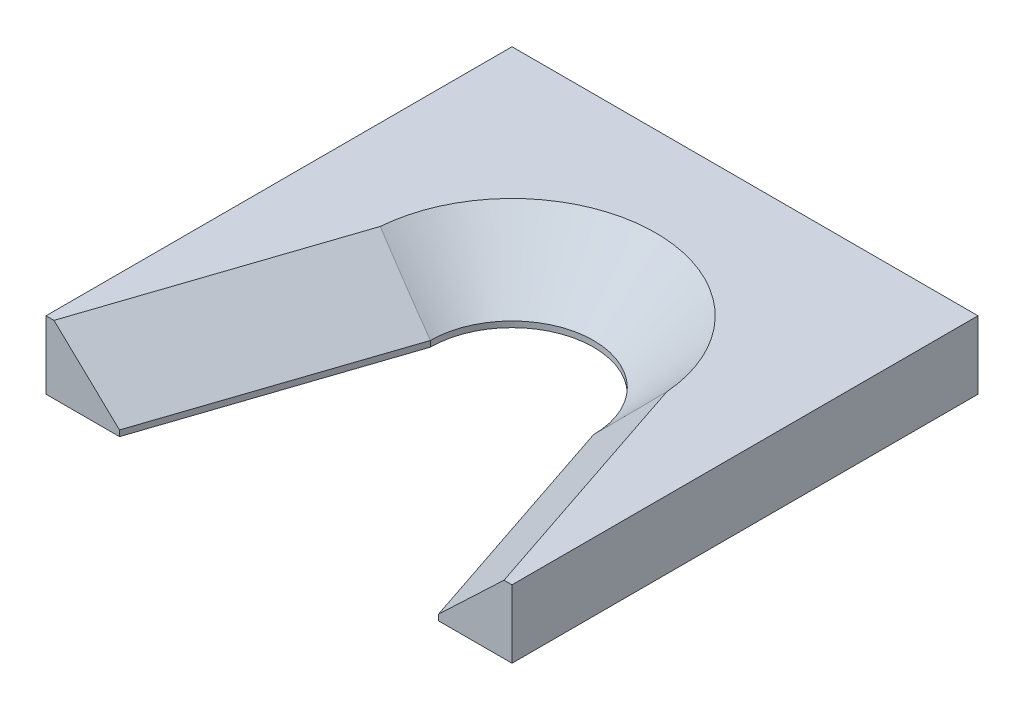
ISO-10303-21;
HEADER;
FILE_DESCRIPTION(('STEP AP214'),'2;1');
FILE_NAME('part.step','',(''),(''),'','','');
FILE_SCHEMA(('AUTOMOTIVE_DESIGN { 1 0 10303 214 1 1 1 1 }'));
ENDSEC;
DATA;
#1=APPLICATION_CONTEXT('core data for automotive mechanical design processes');
#2=APPLICATION_PROTOCOL_DEFINITION('international standard','automotive_design',2000,#1);
#3=PRODUCT_CONTEXT('',#1,'mechanical');
#4=PRODUCT('Part','Part','',(#3));
#5=PRODUCT_RELATED_PRODUCT_CATEGORY('part','',(#4));
#6=PRODUCT_DEFINITION_FORMATION('','',#4);
#7=PRODUCT_DEFINITION_CONTEXT('part definition',#1,'design');
#8=PRODUCT_DEFINITION('design','',#6,#7);
#9=PRODUCT_DEFINITION_SHAPE('','',#8);
#10=(LENGTH_UNIT() NAMED_UNIT(*) SI_UNIT(.MILLI.,.METRE.));
#11=(NAMED_UNIT(*) PLANE_ANGLE_UNIT() SI_UNIT($,.RADIAN.));
#12=(NAMED_UNIT(*) SI_UNIT($,.STERADIAN.) SOLID_ANGLE_UNIT());
#13=UNCERTAINTY_MEASURE_WITH_UNIT(LENGTH_MEASURE(1.E-05),#10,'distance_accuracy_value','');
#14=(GEOMETRIC_REPRESENTATION_CONTEXT(3) GLOBAL_UNCERTAINTY_ASSIGNED_CONTEXT((#13)) GLOBAL_UNIT_ASSIGNED_CONTEXT((#10,
#11,#12)) REPRESENTATION_CONTEXT('',''));
#15=CARTESIAN_POINT('',(0.,0.,0.));
#16=DIRECTION('',(0.,0.,1.));
#17=DIRECTION('',(1.,0.,0.));
#18=AXIS2_PLACEMENT_3D('',#15,#16,#17);
#19=CARTESIAN_POINT('',(0.,11.1125,0.));
#20=DIRECTION('',(0.,-1.,0.));
#21=DIRECTION('',(0.,0.,-1.));
#22=AXIS2_PLACEMENT_3D('',#19,#20,#21);
#23=CYLINDRICAL_SURFACE('',#22,13.335);
#24=DIRECTION('',(0.,-1.,0.));
#25=VECTOR('',#24,1.);
#26=CARTESIAN_POINT('',(13.335,11.1125,0.));
#27=LINE('',#26,#25);
#28=CARTESIAN_POINT('',(13.335,0.952500000000011,0.));
#29=VERTEX_POINT('',#28);
#30=CARTESIAN_POINT('',(13.335,0.,0.));
#31=VERTEX_POINT('',#30);
#32=EDGE_CURVE('E193',#29,#31,#27,.T.);
#33=ORIENTED_EDGE('',*,*,#32,.F.);
#34=CARTESIAN_POINT('',(0.,0.952500000000011,0.));
#35=DIRECTION('',(0.,1.,0.));
#36=DIRECTION('',(0.,0.,1.));
#37=AXIS2_PLACEMENT_3D('',#34,#35,#36);
#38=CIRCLE('',#37,13.335);
#39=CARTESIAN_POINT('',(-13.335,0.952500000000012,0.));
#40=VERTEX_POINT('',#39);
#41=EDGE_CURVE('E73',#29,#40,#38,.T.);
#42=ORIENTED_EDGE('',*,*,#41,.T.);
#43=DIRECTION('',(0.,-1.,0.));
#44=VECTOR('',#43,1.);
#45=CARTESIAN_POINT('',(-13.335,11.1125,0.));
#46=LINE('',#45,#44);
#47=CARTESIAN_POINT('',(-13.335,0.,0.));
#48=VERTEX_POINT('',#47);
#49=EDGE_CURVE('E178',#40,#48,#46,.T.);
#50=ORIENTED_EDGE('',*,*,#49,.T.);
#51=CARTESIAN_POINT('',(0.,0.,0.));
#52=DIRECTION('',(0.,1.,0.));
#53=DIRECTION('',(0.,0.,1.));
#54=AXIS2_PLACEMENT_3D('',#51,#52,#53);
#55=CIRCLE('',#54,13.335);
#56=EDGE_CURVE('E158',#31,#48,#55,.T.);
#57=ORIENTED_EDGE('',*,*,#56,.F.);
#58=EDGE_LOOP('',(#33,#42,#50,#57));
#59=FACE_BOUND('',#58,.T.);
#60=ADVANCED_FACE('F42',(#59),#23,.F.);
#61=CARTESIAN_POINT('',(11.9924022632403,11.1125,-4.01260166686629));
#62=DIRECTION('',(0.948323655206199,0.,-0.317304656405093));
#63=DIRECTION('',(-0.317304656405093,0.,-0.948323655206199));
#64=AXIS2_PLACEMENT_3D('',#61,#62,#63);
#65=PLANE('',#64);
#66=DIRECTION('',(0.,-1.,0.));
#67=VECTOR('',#66,1.);
#68=CARTESIAN_POINT('',(26.083081673029,11.1125,38.1));
#69=LINE('',#68,#67);
#70=CARTESIAN_POINT('',(26.083081673029,0.952500000000009,38.1));
#71=VERTEX_POINT('',#70);
#72=CARTESIAN_POINT('',(26.083081673029,0.,38.1));
#73=VERTEX_POINT('',#72);
#74=EDGE_CURVE('E191',#71,#73,#69,.T.);
#75=ORIENTED_EDGE('',*,*,#74,.F.);
#76=DIRECTION('',(-0.317304656405093,0.,-0.948323655206199));
#77=VECTOR('',#76,1.);
#78=CARTESIAN_POINT('',(13.335,0.952500000000008,0.));
#79=LINE('',#78,#77);
#80=EDGE_CURVE('E204',#71,#29,#79,.T.);
#81=ORIENTED_EDGE('',*,*,#80,.T.);
#82=ORIENTED_EDGE('',*,*,#32,.T.);
#83=DIRECTION('',(0.317304656405093,0.,0.948323655206199));
#84=VECTOR('',#83,1.);
#85=CARTESIAN_POINT('',(11.9924022632403,0.,-4.01260166686629));
#86=LINE('',#85,#84);
#87=EDGE_CURVE('E161',#31,#73,#86,.T.);
#88=ORIENTED_EDGE('',*,*,#87,.T.);
#89=EDGE_LOOP('',(#75,#81,#82,#88));
#90=FACE_BOUND('',#89,.T.);
#91=ADVANCED_FACE('F226',(#90),#65,.F.);
#92=CARTESIAN_POINT('',(0.,11.1125,38.1));
#93=DIRECTION('',(0.,0.,1.));
#94=DIRECTION('',(1.,0.,0.));
#95=AXIS2_PLACEMENT_3D('',#92,#93,#94);
#96=PLANE('',#95);
#97=DIRECTION('',(-1.,0.,0.));
#98=VECTOR('',#97,1.);
#99=CARTESIAN_POINT('',(0.,11.1125,38.1));
#100=LINE('',#99,#98);
#101=CARTESIAN_POINT('',(38.1,11.1125,38.1));
#102=VERTEX_POINT('',#101);
#103=CARTESIAN_POINT('',(36.7967235232799,11.1125,38.1));
#104=VERTEX_POINT('',#103);
#105=EDGE_CURVE('E145',#102,#104,#100,.T.);
#106=ORIENTED_EDGE('',*,*,#105,.T.);
#107=DIRECTION('',(-0.725606535862985,-0.688109842331091,0.));
#108=VECTOR('',#107,1.);
#109=CARTESIAN_POINT('',(17.4230703123026,-7.25999362773124,38.1));
#110=LINE('',#109,#108);
#111=EDGE_CURVE('E202',#104,#71,#110,.T.);
#112=ORIENTED_EDGE('',*,*,#111,.T.);
#113=ORIENTED_EDGE('',*,*,#74,.T.);
#114=DIRECTION('',(-1.,0.,0.));
#115=VECTOR('',#114,1.);
#116=CARTESIAN_POINT('',(0.,0.,38.1));
#117=LINE('',#116,#115);
#118=CARTESIAN_POINT('',(38.1,0.,38.1));
#119=VERTEX_POINT('',#118);
#120=EDGE_CURVE('E164',#119,#73,#117,.T.);
#121=ORIENTED_EDGE('',*,*,#120,.F.);
#122=DIRECTION('',(0.,-1.,0.));
#123=VECTOR('',#122,1.);
#124=CARTESIAN_POINT('',(38.1,11.1125,38.1));
#125=LINE('',#124,#123);
#126=EDGE_CURVE('E189',#102,#119,#125,.T.);
#127=ORIENTED_EDGE('',*,*,#126,.F.);
#128=EDGE_LOOP('',(#106,#112,#113,#121,#127));
#129=FACE_BOUND('',#128,.T.);
#130=ADVANCED_FACE('F230',(#129),#96,.T.);
#131=CARTESIAN_POINT('',(38.1,11.1125,0.));
#132=DIRECTION('',(1.,0.,0.));
#133=DIRECTION('',(0.,0.,-1.));
#134=AXIS2_PLACEMENT_3D('',#131,#132,#133);
#135=PLANE('',#134);
#136=DIRECTION('',(0.,0.,1.));
#137=VECTOR('',#136,1.);
#138=CARTESIAN_POINT('',(38.1,0.,0.));
#139=LINE('',#138,#137);
#140=CARTESIAN_POINT('',(38.1,0.,-38.1));
#141=VERTEX_POINT('',#140);
#142=EDGE_CURVE('E167',#141,#119,#139,.T.);
#143=ORIENTED_EDGE('',*,*,#142,.F.);
#144=DIRECTION('',(0.,-1.,0.));
#145=VECTOR('',#144,1.);
#146=CARTESIAN_POINT('',(38.1,11.1125,-38.1));
#147=LINE('',#146,#145);
#148=CARTESIAN_POINT('',(38.1,11.1125,-38.1));
#149=VERTEX_POINT('',#148);
#150=EDGE_CURVE('E187',#149,#141,#147,.T.);
#151=ORIENTED_EDGE('',*,*,#150,.F.);
#152=DIRECTION('',(0.,0.,1.));
#153=VECTOR('',#152,1.);
#154=CARTESIAN_POINT('',(38.1,11.1125,0.));
#155=LINE('',#154,#153);
#156=EDGE_CURVE('E148',#149,#102,#155,.T.);
#157=ORIENTED_EDGE('',*,*,#156,.T.);
#158=ORIENTED_EDGE('',*,*,#126,.T.);
#159=EDGE_LOOP('',(#143,#151,#157,#158));
#160=FACE_BOUND('',#159,.T.);
#161=ADVANCED_FACE('F234',(#160),#135,.T.);
#162=CARTESIAN_POINT('',(0.,11.1125,-38.1));
#163=DIRECTION('',(0.,0.,1.));
#164=DIRECTION('',(1.,0.,0.));
#165=AXIS2_PLACEMENT_3D('',#162,#163,#164);
#166=PLANE('',#165);
#167=CARTESIAN_POINT('',(0.,5.55625,-38.1));
#168=DIRECTION('',(0.,0.,-1.));
#169=DIRECTION('',(-1.,0.,0.));
#170=AXIS2_PLACEMENT_3D('',#167,#168,#169);
#171=CIRCLE('',#170,1.7272);
#172=CARTESIAN_POINT('',(-1.72719999999999,5.55625,-38.1));
#173=VERTEX_POINT('',#172);
#174=EDGE_CURVE('E139',#173,#173,#171,.T.);
#175=ORIENTED_EDGE('',*,*,#174,.F.);
#176=EDGE_LOOP('',(#175));
#177=FACE_BOUND('',#176,.T.);
#178=DIRECTION('',(-1.,0.,0.));
#179=VECTOR('',#178,1.);
#180=CARTESIAN_POINT('',(0.,0.,-38.1));
#181=LINE('',#180,#179);
#182=CARTESIAN_POINT('',(-38.1,0.,-38.1));
#183=VERTEX_POINT('',#182);
#184=EDGE_CURVE('E171',#141,#183,#181,.T.);
#185=ORIENTED_EDGE('',*,*,#184,.T.);
#186=DIRECTION('',(0.,-1.,0.));
#187=VECTOR('',#186,1.);
#188=CARTESIAN_POINT('',(-38.1,11.1125,-38.1));
#189=LINE('',#188,#187);
#190=CARTESIAN_POINT('',(-38.1,11.1125,-38.1));
#191=VERTEX_POINT('',#190);
#192=EDGE_CURVE('E184',#191,#183,#189,.T.);
#193=ORIENTED_EDGE('',*,*,#192,.F.);
#194=DIRECTION('',(-1.,0.,0.));
#195=VECTOR('',#194,1.);
#196=CARTESIAN_POINT('',(0.,11.1125,-38.1));
#197=LINE('',#196,#195);
#198=EDGE_CURVE('E153',#149,#191,#197,.T.);
#199=ORIENTED_EDGE('',*,*,#198,.F.);
#200=ORIENTED_EDGE('',*,*,#150,.T.);
#201=EDGE_LOOP('',(#185,#193,#199,#200));
#202=FACE_BOUND('',#201,.T.);
#203=ADVANCED_FACE('F237',(#177,#202),#166,.F.);
#204=CARTESIAN_POINT('',(-38.1,11.1125,0.));
#205=DIRECTION('',(1.,0.,0.));
#206=DIRECTION('',(0.,0.,-1.));
#207=AXIS2_PLACEMENT_3D('',#204,#205,#206);
#208=PLANE('',#207);
#209=DIRECTION('',(0.,0.,1.));
#210=VECTOR('',#209,1.);
#211=CARTESIAN_POINT('',(-38.1,0.,0.));
#212=LINE('',#211,#210);
#213=CARTESIAN_POINT('',(-38.1,0.,38.1));
#214=VERTEX_POINT('',#213);
#215=EDGE_CURVE('E173',#183,#214,#212,.T.);
#216=ORIENTED_EDGE('',*,*,#215,.T.);
#217=DIRECTION('',(0.,-1.,0.));
#218=VECTOR('',#217,1.);
#219=CARTESIAN_POINT('',(-38.1,11.1125,38.1));
#220=LINE('',#219,#218);
#221=CARTESIAN_POINT('',(-38.1,11.1125,38.1));
#222=VERTEX_POINT('',#221);
#223=EDGE_CURVE('E182',#222,#214,#220,.T.);
#224=ORIENTED_EDGE('',*,*,#223,.F.);
#225=DIRECTION('',(0.,0.,1.));
#226=VECTOR('',#225,1.);
#227=CARTESIAN_POINT('',(-38.1,11.1125,0.));
#228=LINE('',#227,#226);
#229=EDGE_CURVE('E155',#191,#222,#228,.T.);
#230=ORIENTED_EDGE('',*,*,#229,.F.);
#231=ORIENTED_EDGE('',*,*,#192,.T.);
#232=EDGE_LOOP('',(#216,#224,#230,#231));
#233=FACE_BOUND('',#232,.T.);
#234=ADVANCED_FACE('F241',(#233),#208,.F.);
#235=DIRECTION('',(0.,-1.,0.));
#236=VECTOR('',#235,1.);
#237=CARTESIAN_POINT('',(-26.083081673029,11.1125,38.1));
#238=LINE('',#237,#236);
#239=CARTESIAN_POINT('',(-26.083081673029,0.952500000000012,38.1));
#240=VERTEX_POINT('',#239);
#241=CARTESIAN_POINT('',(-26.083081673029,0.,38.1));
#242=VERTEX_POINT('',#241);
#243=EDGE_CURVE('E180',#240,#242,#238,.T.);
#244=ORIENTED_EDGE('',*,*,#243,.F.);
#245=DIRECTION('',(0.725606535862985,-0.688109842331091,0.));
#246=VECTOR('',#245,1.);
#247=CARTESIAN_POINT('',(-17.4230703123026,-7.25999362773123,38.1));
#248=LINE('',#247,#246);
#249=CARTESIAN_POINT('',(-36.7967235232799,11.1125,38.1));
#250=VERTEX_POINT('',#249);
#251=EDGE_CURVE('E11',#240,#250,#248,.F.);
#252=ORIENTED_EDGE('',*,*,#251,.T.);
#253=EDGE_CURVE('E150',#250,#222,#100,.T.);
#254=ORIENTED_EDGE('',*,*,#253,.T.);
#255=ORIENTED_EDGE('',*,*,#223,.T.);
#256=EDGE_CURVE('E168',#242,#214,#117,.T.);
#257=ORIENTED_EDGE('',*,*,#256,.F.);
#258=EDGE_LOOP('',(#244,#252,#254,#255,#257));
#259=FACE_BOUND('',#258,.T.);
#260=ADVANCED_FACE('F245',(#259),#96,.T.);
#261=CARTESIAN_POINT('',(-11.9924022632403,11.1125,-4.01260166686629));
#262=DIRECTION('',(0.948323655206199,0.,0.317304656405093));
#263=DIRECTION('',(0.317304656405093,0.,-0.948323655206199));
#264=AXIS2_PLACEMENT_3D('',#261,#262,#263);
#265=PLANE('',#264);
#266=ORIENTED_EDGE('',*,*,#49,.F.);
#267=DIRECTION('',(-0.317304656405093,0.,0.948323655206199));
#268=VECTOR('',#267,1.);
#269=CARTESIAN_POINT('',(-11.9924022632403,0.952500000000012,-4.01260166686629));
#270=LINE('',#269,#268);
#271=EDGE_CURVE('E58',#40,#240,#270,.T.);
#272=ORIENTED_EDGE('',*,*,#271,.T.);
#273=ORIENTED_EDGE('',*,*,#243,.T.);
#274=DIRECTION('',(-0.317304656405093,0.,0.948323655206199));
#275=VECTOR('',#274,1.);
#276=CARTESIAN_POINT('',(-11.9924022632403,0.,-4.01260166686629));
#277=LINE('',#276,#275);
#278=EDGE_CURVE('E149',#48,#242,#277,.T.);
#279=ORIENTED_EDGE('',*,*,#278,.F.);
#280=EDGE_LOOP('',(#266,#272,#273,#279));
#281=FACE_BOUND('',#280,.T.);
#282=ADVANCED_FACE('F249',(#281),#265,.T.);
#283=CARTESIAN_POINT('',(0.,11.1125,0.));
#284=DIRECTION('',(0.,1.,0.));
#285=DIRECTION('',(0.,0.,1.));
#286=AXIS2_PLACEMENT_3D('',#283,#284,#285);
#287=PLANE('',#286);
#288=CARTESIAN_POINT('',(0.,11.1125,0.));
#289=DIRECTION('',(0.,1.,0.));
#290=DIRECTION('',(0.,0.,1.));
#291=AXIS2_PLACEMENT_3D('',#288,#289,#290);
#292=CIRCLE('',#291,23.495);
#293=CARTESIAN_POINT('',(-23.4196823274798,11.1125,-1.87976186787994));
#294=VERTEX_POINT('',#293);
#295=CARTESIAN_POINT('',(23.4196823274797,11.1125,-1.87976186788));
#296=VERTEX_POINT('',#295);
#297=EDGE_CURVE('E197',#294,#296,#292,.F.);
#298=ORIENTED_EDGE('',*,*,#297,.T.);
#299=DIRECTION('',(0.317304656405093,0.,0.948323655206199));
#300=VECTOR('',#299,1.);
#301=CARTESIAN_POINT('',(35.718050009924,11.1125,34.8761846909243));
#302=LINE('',#301,#300);
#303=EDGE_CURVE('E199',#296,#104,#302,.T.);
#304=ORIENTED_EDGE('',*,*,#303,.T.);
#305=ORIENTED_EDGE('',*,*,#105,.F.);
#306=ORIENTED_EDGE('',*,*,#156,.F.);
#307=ORIENTED_EDGE('',*,*,#198,.T.);
#308=ORIENTED_EDGE('',*,*,#229,.T.);
#309=ORIENTED_EDGE('',*,*,#253,.F.);
#310=DIRECTION('',(0.317304656405093,0.,-0.948323655206199));
#311=VECTOR('',#310,1.);
#312=CARTESIAN_POINT('',(-21.6273706001353,11.1125,-7.23641697594204));
#313=LINE('',#312,#311);
#314=EDGE_CURVE('E195',#250,#294,#313,.T.);
#315=ORIENTED_EDGE('',*,*,#314,.T.);
#316=EDGE_LOOP('',(#298,#304,#305,#306,#307,#308,#309,#315));
#317=FACE_BOUND('',#316,.T.);
#318=ADVANCED_FACE('F253',(#317),#287,.T.);
#319=CARTESIAN_POINT('',(0.,0.,0.));
#320=DIRECTION('',(0.,1.,0.));
#321=DIRECTION('',(0.,0.,1.));
#322=AXIS2_PLACEMENT_3D('',#319,#320,#321);
#323=PLANE('',#322);
#324=ORIENTED_EDGE('',*,*,#56,.T.);
#325=ORIENTED_EDGE('',*,*,#278,.T.);
#326=ORIENTED_EDGE('',*,*,#256,.T.);
#327=ORIENTED_EDGE('',*,*,#215,.F.);
#328=ORIENTED_EDGE('',*,*,#184,.F.);
#329=ORIENTED_EDGE('',*,*,#142,.T.);
#330=ORIENTED_EDGE('',*,*,#120,.T.);
#331=ORIENTED_EDGE('',*,*,#87,.F.);
#332=EDGE_LOOP('',(#324,#325,#326,#327,#328,#329,#330,#331));
#333=FACE_BOUND('',#332,.T.);
#334=ADVANCED_FACE('F254',(#333),#323,.F.);
#335=CARTESIAN_POINT('',(-11.9924022632403,0.952500000000011,-4.01260166686629));
#336=DIRECTION('',(-0.670566087355916,-0.707106781186549,-0.224368274246108));
#337=DIRECTION('',(-0.317304656405093,0.,0.948323655206199));
#338=AXIS2_PLACEMENT_3D('',#335,#336,#337);
#339=PLANE('',#338);
#340=ORIENTED_EDGE('',*,*,#251,.F.);
#341=ORIENTED_EDGE('',*,*,#271,.F.);
#342=CARTESIAN_POINT('',(-13.335,0.952500000000012,0.));
#343=CARTESIAN_POINT('',(-14.1802182107889,1.79777629778931,-0.137835590509843));
#344=CARTESIAN_POINT('',(-15.0239193030969,2.64354546694068,-0.28175867663717));
#345=CARTESIAN_POINT('',(-16.708748163143,4.33580986815329,-0.579583925492418));
#346=CARTESIAN_POINT('',(-17.5498760556182,5.1823050623891,-0.733485596212048));
#347=CARTESIAN_POINT('',(-19.2300756855446,6.87581802542853,-1.04908105467809));
#348=CARTESIAN_POINT('',(-20.0691474880417,7.72283577661118,-1.21077459248934));
#349=CARTESIAN_POINT('',(-21.7456096435228,9.41734861276061,-1.54069133003352));
#350=CARTESIAN_POINT('',(-22.5829999124839,10.2648437189974,-1.70891484791784));
#351=CARTESIAN_POINT('',(-23.4196823274798,11.1125,-1.87976186787987));
#352=B_SPLINE_CURVE_WITH_KNOTS('',3,(#342,#343,#344,#345,#346,#347,#348,#349,#350,#351),
.UNSPECIFIED.,.F.,.F.,(4,2,2,2,4),(0.,3.60979400428527,7.21941015770133,10.8289106045433,
14.4385871334727),.UNSPECIFIED.);
#353=EDGE_CURVE('E48',#294,#40,#352,.F.);
#354=ORIENTED_EDGE('',*,*,#353,.F.);
#355=ORIENTED_EDGE('',*,*,#314,.F.);
#356=EDGE_LOOP('',(#340,#341,#354,#355));
#357=FACE_BOUND('',#356,.T.);
#358=ADVANCED_FACE('F45',(#357),#339,.F.);
#359=CARTESIAN_POINT('',(0.,0.952500000000011,0.));
#360=DIRECTION('',(0.,1.,0.));
#361=DIRECTION('',(0.,0.,1.));
#362=AXIS2_PLACEMENT_3D('',#359,#360,#361);
#363=CONICAL_SURFACE('',#362,13.335,0.78539816339745);
#364=ORIENTED_EDGE('',*,*,#353,.T.);
#365=ORIENTED_EDGE('',*,*,#41,.F.);
#366=CARTESIAN_POINT('',(13.335,0.952500000000011,0.));
#367=CARTESIAN_POINT('',(14.1802182107889,1.79777629778931,-0.137835590509873));
#368=CARTESIAN_POINT('',(15.0239193030969,2.64354546694069,-0.281758676637214));
#369=CARTESIAN_POINT('',(16.708748163143,4.3358098681533,-0.579583925492474));
#370=CARTESIAN_POINT('',(17.5498760556182,5.18230506238911,-0.733485596212103));
#371=CARTESIAN_POINT('',(19.2300756855446,6.87581802542855,-1.04908105467815));
#372=CARTESIAN_POINT('',(20.0691474880417,7.72283577661119,-1.2107745924894));
#373=CARTESIAN_POINT('',(21.7456096435228,9.41734861276063,-1.5406913300336));
#374=CARTESIAN_POINT('',(22.5829999124839,10.2648437189975,-1.70891484791793));
#375=CARTESIAN_POINT('',(23.4196823274798,11.1125,-1.87976186787997));
#376=B_SPLINE_CURVE_WITH_KNOTS('',3,(#366,#367,#368,#369,#370,#371,#372,#373,#374,#375),
.UNSPECIFIED.,.F.,.F.,(4,2,2,2,4),(0.,3.60979400428527,7.21941015770135,10.8289106045433,
14.4385871334728),.UNSPECIFIED.);
#377=EDGE_CURVE('E138',#296,#29,#376,.F.);
#378=ORIENTED_EDGE('',*,*,#377,.F.);
#379=ORIENTED_EDGE('',*,*,#297,.F.);
#380=EDGE_LOOP('',(#364,#365,#378,#379));
#381=FACE_BOUND('',#380,.T.);
#382=ADVANCED_FACE('F212',(#381),#363,.F.);
#383=CARTESIAN_POINT('',(21.6273706001353,11.1125,-7.23641697594204));
#384=DIRECTION('',(-0.670566087355915,0.707106781186549,0.224368274246108));
#385=DIRECTION('',(-0.317304656405093,0.,-0.948323655206199));
#386=AXIS2_PLACEMENT_3D('',#383,#384,#385);
#387=PLANE('',#386);
#388=ORIENTED_EDGE('',*,*,#377,.T.);
#389=ORIENTED_EDGE('',*,*,#80,.F.);
#390=ORIENTED_EDGE('',*,*,#111,.F.);
#391=ORIENTED_EDGE('',*,*,#303,.F.);
#392=EDGE_LOOP('',(#388,#389,#390,#391));
#393=FACE_BOUND('',#392,.T.);
#394=ADVANCED_FACE('F132',(#393),#387,.T.);
#395=CARTESIAN_POINT('',(0.,5.55625,-22.86));
#396=DIRECTION('',(0.,0.,-1.));
#397=DIRECTION('',(-1.,0.,0.));
#398=AXIS2_PLACEMENT_3D('',#395,#396,#397);
#399=CONICAL_SURFACE('',#398,1.7272,1.02974425867665);
#400=CARTESIAN_POINT('',(0.,5.55625,-21.8221935388156));
#401=VERTEX_POINT('',#400);
#402=VERTEX_LOOP('',#401);
#403=FACE_BOUND('',#402,.T.);
#404=CARTESIAN_POINT('',(0.,5.55625,-22.86));
#405=DIRECTION('',(0.,0.,-1.));
#406=DIRECTION('',(-1.,0.,0.));
#407=AXIS2_PLACEMENT_3D('',#404,#405,#406);
#408=CIRCLE('',#407,1.7272);
#409=CARTESIAN_POINT('',(-1.72719999999999,5.55625,-22.86));
#410=VERTEX_POINT('',#409);
#411=EDGE_CURVE('E136',#410,#410,#408,.T.);
#412=ORIENTED_EDGE('',*,*,#411,.T.);
#413=EDGE_LOOP('',(#412));
#414=FACE_BOUND('',#413,.T.);
#415=ADVANCED_FACE('F128',(#403,#414),#399,.F.);
#416=CARTESIAN_POINT('',(0.,5.55625,-38.1));
#417=DIRECTION('',(0.,0.,-1.));
#418=DIRECTION('',(-1.,0.,0.));
#419=AXIS2_PLACEMENT_3D('',#416,#417,#418);
#420=CYLINDRICAL_SURFACE('',#419,1.7272);
#421=ORIENTED_EDGE('',*,*,#411,.F.);
#422=EDGE_LOOP('',(#421));
#423=FACE_BOUND('',#422,.T.);
#424=ORIENTED_EDGE('',*,*,#174,.T.);
#425=EDGE_LOOP('',(#424));
#426=FACE_BOUND('',#425,.T.);
#427=ADVANCED_FACE('F131',(#423,#426),#420,.F.);
#428=CLOSED_SHELL('',(#60,#91,#130,#161,#203,#234,#260,#282,#318,#334,#358,#382,#394,#415,#427));
#429=MANIFOLD_SOLID_BREP('B2',#428);
#430=ADVANCED_BREP_SHAPE_REPRESENTATION('',(#18,#429),#14);
#431=SHAPE_DEFINITION_REPRESENTATION(#9,#430);
ENDSEC;
END-ISO-10303-21;
